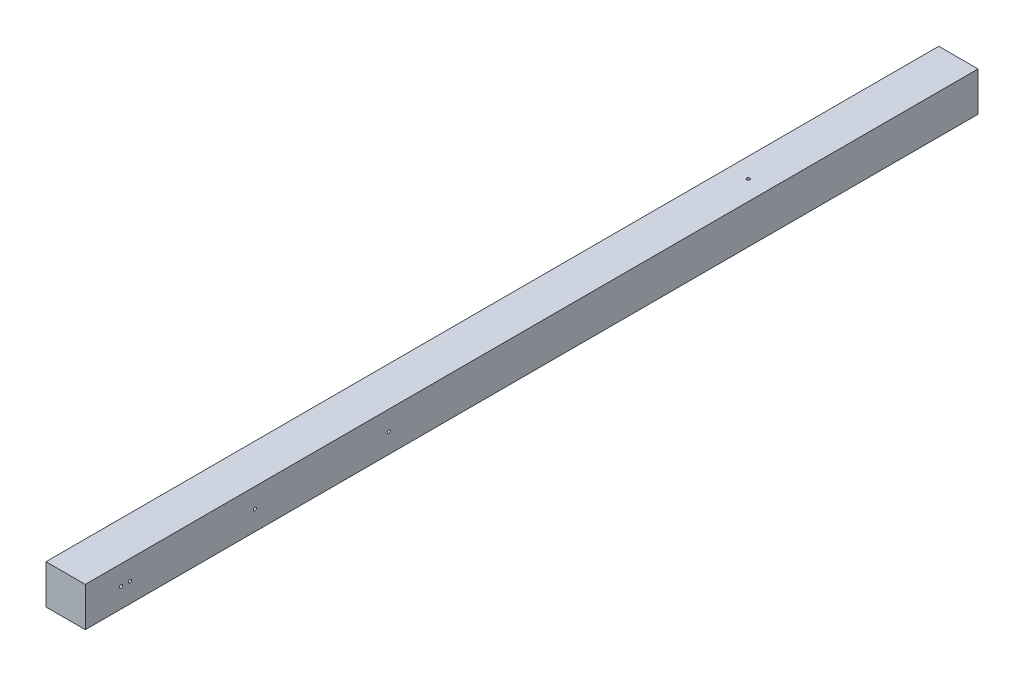
ISO-10303-21;
HEADER;
FILE_DESCRIPTION(('STEP AP214'),'2;1');
FILE_NAME('part.step','',(''),(''),'','','');
FILE_SCHEMA(('AUTOMOTIVE_DESIGN { 1 0 10303 214 1 1 1 1 }'));
ENDSEC;
DATA;
#1=APPLICATION_CONTEXT('core data for automotive mechanical design processes');
#2=APPLICATION_PROTOCOL_DEFINITION('international standard','automotive_design',2000,#1);
#3=PRODUCT_CONTEXT('',#1,'mechanical');
#4=PRODUCT('Part','Part','',(#3));
#5=PRODUCT_RELATED_PRODUCT_CATEGORY('part','',(#4));
#6=PRODUCT_DEFINITION_FORMATION('','',#4);
#7=PRODUCT_DEFINITION_CONTEXT('part definition',#1,'design');
#8=PRODUCT_DEFINITION('design','',#6,#7);
#9=PRODUCT_DEFINITION_SHAPE('','',#8);
#10=(LENGTH_UNIT() NAMED_UNIT(*) SI_UNIT(.MILLI.,.METRE.));
#11=(NAMED_UNIT(*) PLANE_ANGLE_UNIT() SI_UNIT($,.RADIAN.));
#12=(NAMED_UNIT(*) SI_UNIT($,.STERADIAN.) SOLID_ANGLE_UNIT());
#13=UNCERTAINTY_MEASURE_WITH_UNIT(LENGTH_MEASURE(1.E-05),#10,'distance_accuracy_value','');
#14=(GEOMETRIC_REPRESENTATION_CONTEXT(3) GLOBAL_UNCERTAINTY_ASSIGNED_CONTEXT((#13)) GLOBAL_UNIT_ASSIGNED_CONTEXT((#10,
#11,#12)) REPRESENTATION_CONTEXT('',''));
#15=CARTESIAN_POINT('',(0.,0.,0.));
#16=DIRECTION('',(0.,0.,1.));
#17=DIRECTION('',(1.,0.,0.));
#18=AXIS2_PLACEMENT_3D('',#15,#16,#17);
#19=CARTESIAN_POINT('',(-22.,22.,1000.));
#20=DIRECTION('',(1.,0.,0.));
#21=DIRECTION('',(0.,1.,0.));
#22=AXIS2_PLACEMENT_3D('',#19,#20,#21);
#23=PLANE('',#22);
#24=CARTESIAN_POINT('',(-22.,0.,660.));
#25=DIRECTION('',(-1.,0.,0.));
#26=DIRECTION('',(0.,-1.,0.));
#27=AXIS2_PLACEMENT_3D('',#24,#25,#26);
#28=CIRCLE('',#27,1.75000000000009);
#29=CARTESIAN_POINT('',(-22.,-1.75000000000009,660.));
#30=VERTEX_POINT('',#29);
#31=EDGE_CURVE('E128',#30,#30,#28,.T.);
#32=ORIENTED_EDGE('',*,*,#31,.F.);
#33=EDGE_LOOP('',(#32));
#34=FACE_BOUND('',#33,.T.);
#35=CARTESIAN_POINT('',(-22.,0.,810.));
#36=DIRECTION('',(-1.,0.,0.));
#37=DIRECTION('',(0.,-1.,0.));
#38=AXIS2_PLACEMENT_3D('',#35,#36,#37);
#39=CIRCLE('',#38,1.74999999999999);
#40=CARTESIAN_POINT('',(-22.,-1.74999999999999,810.));
#41=VERTEX_POINT('',#40);
#42=EDGE_CURVE('E136',#41,#41,#39,.T.);
#43=ORIENTED_EDGE('',*,*,#42,.F.);
#44=EDGE_LOOP('',(#43));
#45=FACE_BOUND('',#44,.T.);
#46=CARTESIAN_POINT('',(-22.,0.,960.));
#47=DIRECTION('',(-1.,0.,0.));
#48=DIRECTION('',(0.,-1.,0.));
#49=AXIS2_PLACEMENT_3D('',#46,#47,#48);
#50=CIRCLE('',#49,1.74999999999999);
#51=CARTESIAN_POINT('',(-22.,-1.74999999999999,960.));
#52=VERTEX_POINT('',#51);
#53=EDGE_CURVE('E127',#52,#52,#50,.T.);
#54=ORIENTED_EDGE('',*,*,#53,.F.);
#55=EDGE_LOOP('',(#54));
#56=FACE_BOUND('',#55,.T.);
#57=CARTESIAN_POINT('',(-22.,0.,950.));
#58=DIRECTION('',(-1.,0.,0.));
#59=DIRECTION('',(0.,-1.,0.));
#60=AXIS2_PLACEMENT_3D('',#57,#58,#59);
#61=CIRCLE('',#60,1.74999999999999);
#62=CARTESIAN_POINT('',(-22.,-1.74999999999999,950.));
#63=VERTEX_POINT('',#62);
#64=EDGE_CURVE('E124',#63,#63,#61,.T.);
#65=ORIENTED_EDGE('',*,*,#64,.F.);
#66=EDGE_LOOP('',(#65));
#67=FACE_BOUND('',#66,.T.);
#68=DIRECTION('',(0.,-1.,0.));
#69=VECTOR('',#68,1.);
#70=CARTESIAN_POINT('',(-22.,22.,0.));
#71=LINE('',#70,#69);
#72=CARTESIAN_POINT('',(-22.,22.,0.));
#73=VERTEX_POINT('',#72);
#74=CARTESIAN_POINT('',(-22.,-22.,0.));
#75=VERTEX_POINT('',#74);
#76=EDGE_CURVE('E108',#73,#75,#71,.T.);
#77=ORIENTED_EDGE('',*,*,#76,.T.);
#78=DIRECTION('',(0.,0.,-1.));
#79=VECTOR('',#78,1.);
#80=CARTESIAN_POINT('',(-22.,-22.,1000.));
#81=LINE('',#80,#79);
#82=CARTESIAN_POINT('',(-22.,-22.,1000.));
#83=VERTEX_POINT('',#82);
#84=EDGE_CURVE('E11',#83,#75,#81,.T.);
#85=ORIENTED_EDGE('',*,*,#84,.F.);
#86=DIRECTION('',(0.,-1.,0.));
#87=VECTOR('',#86,1.);
#88=CARTESIAN_POINT('',(-22.,22.,1000.));
#89=LINE('',#88,#87);
#90=CARTESIAN_POINT('',(-22.,22.,1000.));
#91=VERTEX_POINT('',#90);
#92=EDGE_CURVE('E96',#91,#83,#89,.T.);
#93=ORIENTED_EDGE('',*,*,#92,.F.);
#94=DIRECTION('',(0.,0.,-1.));
#95=VECTOR('',#94,1.);
#96=CARTESIAN_POINT('',(-22.,22.,1000.));
#97=LINE('',#96,#95);
#98=EDGE_CURVE('E104',#91,#73,#97,.T.);
#99=ORIENTED_EDGE('',*,*,#98,.T.);
#100=EDGE_LOOP('',(#77,#85,#93,#99));
#101=FACE_BOUND('',#100,.T.);
#102=ADVANCED_FACE('F45',(#34,#45,#56,#67,#101),#23,.F.);
#103=CARTESIAN_POINT('',(22.,-22.,1000.));
#104=DIRECTION('',(0.,1.,0.));
#105=DIRECTION('',(-1.,0.,0.));
#106=AXIS2_PLACEMENT_3D('',#103,#104,#105);
#107=PLANE('',#106);
#108=CARTESIAN_POINT('',(0.,-22.,235.31));
#109=DIRECTION('',(0.,1.,0.));
#110=DIRECTION('',(-1.,0.,0.));
#111=AXIS2_PLACEMENT_3D('',#108,#109,#110);
#112=CIRCLE('',#111,1.75);
#113=CARTESIAN_POINT('',(-1.75,-22.,235.31));
#114=VERTEX_POINT('',#113);
#115=EDGE_CURVE('E135',#114,#114,#112,.F.);
#116=ORIENTED_EDGE('',*,*,#115,.F.);
#117=EDGE_LOOP('',(#116));
#118=FACE_BOUND('',#117,.T.);
#119=DIRECTION('',(1.,0.,0.));
#120=VECTOR('',#119,1.);
#121=CARTESIAN_POINT('',(22.,-22.,0.));
#122=LINE('',#121,#120);
#123=CARTESIAN_POINT('',(22.,-22.,0.));
#124=VERTEX_POINT('',#123);
#125=EDGE_CURVE('E100',#75,#124,#122,.T.);
#126=ORIENTED_EDGE('',*,*,#125,.T.);
#127=DIRECTION('',(0.,0.,-1.));
#128=VECTOR('',#127,1.);
#129=CARTESIAN_POINT('',(22.,-22.,1000.));
#130=LINE('',#129,#128);
#131=CARTESIAN_POINT('',(22.,-22.,1000.));
#132=VERTEX_POINT('',#131);
#133=EDGE_CURVE('E53',#132,#124,#130,.T.);
#134=ORIENTED_EDGE('',*,*,#133,.F.);
#135=DIRECTION('',(1.,0.,0.));
#136=VECTOR('',#135,1.);
#137=CARTESIAN_POINT('',(22.,-22.,1000.));
#138=LINE('',#137,#136);
#139=EDGE_CURVE('E91',#83,#132,#138,.T.);
#140=ORIENTED_EDGE('',*,*,#139,.F.);
#141=ORIENTED_EDGE('',*,*,#84,.T.);
#142=EDGE_LOOP('',(#126,#134,#140,#141));
#143=FACE_BOUND('',#142,.T.);
#144=ADVANCED_FACE('F99',(#118,#143),#107,.F.);
#145=CARTESIAN_POINT('',(22.,22.,1000.));
#146=DIRECTION('',(-1.,0.,0.));
#147=DIRECTION('',(0.,-1.,0.));
#148=AXIS2_PLACEMENT_3D('',#145,#146,#147);
#149=PLANE('',#148);
#150=CARTESIAN_POINT('',(22.,0.,660.));
#151=DIRECTION('',(-1.,0.,0.));
#152=DIRECTION('',(0.,-1.,0.));
#153=AXIS2_PLACEMENT_3D('',#150,#151,#152);
#154=CIRCLE('',#153,1.75000000000009);
#155=CARTESIAN_POINT('',(22.,-1.75000000000009,660.));
#156=VERTEX_POINT('',#155);
#157=EDGE_CURVE('E132',#156,#156,#154,.F.);
#158=ORIENTED_EDGE('',*,*,#157,.F.);
#159=EDGE_LOOP('',(#158));
#160=FACE_BOUND('',#159,.T.);
#161=CARTESIAN_POINT('',(22.,0.,810.));
#162=DIRECTION('',(-1.,0.,0.));
#163=DIRECTION('',(0.,-1.,0.));
#164=AXIS2_PLACEMENT_3D('',#161,#162,#163);
#165=CIRCLE('',#164,1.74999999999999);
#166=CARTESIAN_POINT('',(22.,-1.74999999999998,810.));
#167=VERTEX_POINT('',#166);
#168=EDGE_CURVE('E131',#167,#167,#165,.F.);
#169=ORIENTED_EDGE('',*,*,#168,.F.);
#170=EDGE_LOOP('',(#169));
#171=FACE_BOUND('',#170,.T.);
#172=CARTESIAN_POINT('',(22.,0.,960.));
#173=DIRECTION('',(-1.,0.,0.));
#174=DIRECTION('',(0.,-1.,0.));
#175=AXIS2_PLACEMENT_3D('',#172,#173,#174);
#176=CIRCLE('',#175,1.74999999999999);
#177=CARTESIAN_POINT('',(22.,-1.74999999999998,960.));
#178=VERTEX_POINT('',#177);
#179=EDGE_CURVE('E139',#178,#178,#176,.F.);
#180=ORIENTED_EDGE('',*,*,#179,.F.);
#181=EDGE_LOOP('',(#180));
#182=FACE_BOUND('',#181,.T.);
#183=CARTESIAN_POINT('',(22.,0.,950.));
#184=DIRECTION('',(-1.,0.,0.));
#185=DIRECTION('',(0.,-1.,0.));
#186=AXIS2_PLACEMENT_3D('',#183,#184,#185);
#187=CIRCLE('',#186,1.74999999999999);
#188=CARTESIAN_POINT('',(22.,-1.74999999999998,950.));
#189=VERTEX_POINT('',#188);
#190=EDGE_CURVE('E111',#189,#189,#187,.F.);
#191=ORIENTED_EDGE('',*,*,#190,.F.);
#192=EDGE_LOOP('',(#191));
#193=FACE_BOUND('',#192,.T.);
#194=DIRECTION('',(0.,1.,0.));
#195=VECTOR('',#194,1.);
#196=CARTESIAN_POINT('',(22.,22.,0.));
#197=LINE('',#196,#195);
#198=CARTESIAN_POINT('',(22.,22.,0.));
#199=VERTEX_POINT('',#198);
#200=EDGE_CURVE('E78',#124,#199,#197,.T.);
#201=ORIENTED_EDGE('',*,*,#200,.T.);
#202=DIRECTION('',(0.,0.,-1.));
#203=VECTOR('',#202,1.);
#204=CARTESIAN_POINT('',(22.,22.,1000.));
#205=LINE('',#204,#203);
#206=CARTESIAN_POINT('',(22.,22.,1000.));
#207=VERTEX_POINT('',#206);
#208=EDGE_CURVE('E101',#207,#199,#205,.T.);
#209=ORIENTED_EDGE('',*,*,#208,.F.);
#210=DIRECTION('',(0.,1.,0.));
#211=VECTOR('',#210,1.);
#212=CARTESIAN_POINT('',(22.,22.,1000.));
#213=LINE('',#212,#211);
#214=EDGE_CURVE('E94',#132,#207,#213,.T.);
#215=ORIENTED_EDGE('',*,*,#214,.F.);
#216=ORIENTED_EDGE('',*,*,#133,.T.);
#217=EDGE_LOOP('',(#201,#209,#215,#216));
#218=FACE_BOUND('',#217,.T.);
#219=ADVANCED_FACE('F102',(#160,#171,#182,#193,#218),#149,.F.);
#220=CARTESIAN_POINT('',(22.,22.,1000.));
#221=DIRECTION('',(0.,-1.,0.));
#222=DIRECTION('',(1.,0.,0.));
#223=AXIS2_PLACEMENT_3D('',#220,#221,#222);
#224=PLANE('',#223);
#225=CARTESIAN_POINT('',(0.,22.,235.31));
#226=DIRECTION('',(0.,1.,0.));
#227=DIRECTION('',(-1.,0.,0.));
#228=AXIS2_PLACEMENT_3D('',#225,#226,#227);
#229=CIRCLE('',#228,1.75);
#230=CARTESIAN_POINT('',(-1.75,22.,235.31));
#231=VERTEX_POINT('',#230);
#232=EDGE_CURVE('E148',#231,#231,#229,.T.);
#233=ORIENTED_EDGE('',*,*,#232,.F.);
#234=EDGE_LOOP('',(#233));
#235=FACE_BOUND('',#234,.T.);
#236=DIRECTION('',(-1.,0.,0.));
#237=VECTOR('',#236,1.);
#238=CARTESIAN_POINT('',(22.,22.,0.));
#239=LINE('',#238,#237);
#240=EDGE_CURVE('E84',#199,#73,#239,.T.);
#241=ORIENTED_EDGE('',*,*,#240,.T.);
#242=ORIENTED_EDGE('',*,*,#98,.F.);
#243=DIRECTION('',(-1.,0.,0.));
#244=VECTOR('',#243,1.);
#245=CARTESIAN_POINT('',(22.,22.,1000.));
#246=LINE('',#245,#244);
#247=EDGE_CURVE('E61',#207,#91,#246,.T.);
#248=ORIENTED_EDGE('',*,*,#247,.F.);
#249=ORIENTED_EDGE('',*,*,#208,.T.);
#250=EDGE_LOOP('',(#241,#242,#248,#249));
#251=FACE_BOUND('',#250,.T.);
#252=ADVANCED_FACE('F116',(#235,#251),#224,.F.);
#253=CARTESIAN_POINT('',(0.,0.,1000.));
#254=DIRECTION('',(0.,0.,-1.));
#255=DIRECTION('',(-1.,0.,0.));
#256=AXIS2_PLACEMENT_3D('',#253,#254,#255);
#257=PLANE('',#256);
#258=ORIENTED_EDGE('',*,*,#92,.T.);
#259=ORIENTED_EDGE('',*,*,#139,.T.);
#260=ORIENTED_EDGE('',*,*,#214,.T.);
#261=ORIENTED_EDGE('',*,*,#247,.T.);
#262=EDGE_LOOP('',(#258,#259,#260,#261));
#263=FACE_BOUND('',#262,.T.);
#264=ADVANCED_FACE('F92',(#263),#257,.F.);
#265=CARTESIAN_POINT('',(0.,0.,0.));
#266=DIRECTION('',(0.,0.,-1.));
#267=DIRECTION('',(-1.,0.,0.));
#268=AXIS2_PLACEMENT_3D('',#265,#266,#267);
#269=PLANE('',#268);
#270=ORIENTED_EDGE('',*,*,#76,.F.);
#271=ORIENTED_EDGE('',*,*,#240,.F.);
#272=ORIENTED_EDGE('',*,*,#200,.F.);
#273=ORIENTED_EDGE('',*,*,#125,.F.);
#274=EDGE_LOOP('',(#270,#271,#272,#273));
#275=FACE_BOUND('',#274,.T.);
#276=ADVANCED_FACE('F119',(#275),#269,.T.);
#277=CARTESIAN_POINT('',(26.9497474683062,0.,950.));
#278=DIRECTION('',(-1.,0.,0.));
#279=DIRECTION('',(0.,-1.,0.));
#280=AXIS2_PLACEMENT_3D('',#277,#278,#279);
#281=CYLINDRICAL_SURFACE('',#280,1.74999999999999);
#282=ORIENTED_EDGE('',*,*,#190,.T.);
#283=EDGE_LOOP('',(#282));
#284=FACE_BOUND('',#283,.T.);
#285=ORIENTED_EDGE('',*,*,#64,.T.);
#286=EDGE_LOOP('',(#285));
#287=FACE_BOUND('',#286,.T.);
#288=ADVANCED_FACE('F180',(#284,#287),#281,.F.);
#289=CARTESIAN_POINT('',(26.9497474683062,0.,960.));
#290=DIRECTION('',(-1.,0.,0.));
#291=DIRECTION('',(0.,-1.,0.));
#292=AXIS2_PLACEMENT_3D('',#289,#290,#291);
#293=CYLINDRICAL_SURFACE('',#292,1.74999999999999);
#294=ORIENTED_EDGE('',*,*,#179,.T.);
#295=EDGE_LOOP('',(#294));
#296=FACE_BOUND('',#295,.T.);
#297=ORIENTED_EDGE('',*,*,#53,.T.);
#298=EDGE_LOOP('',(#297));
#299=FACE_BOUND('',#298,.T.);
#300=ADVANCED_FACE('F182',(#296,#299),#293,.F.);
#301=CARTESIAN_POINT('',(26.9497474683062,0.,810.));
#302=DIRECTION('',(-1.,0.,0.));
#303=DIRECTION('',(0.,-1.,0.));
#304=AXIS2_PLACEMENT_3D('',#301,#302,#303);
#305=CYLINDRICAL_SURFACE('',#304,1.74999999999999);
#306=ORIENTED_EDGE('',*,*,#168,.T.);
#307=EDGE_LOOP('',(#306));
#308=FACE_BOUND('',#307,.T.);
#309=ORIENTED_EDGE('',*,*,#42,.T.);
#310=EDGE_LOOP('',(#309));
#311=FACE_BOUND('',#310,.T.);
#312=ADVANCED_FACE('F188',(#308,#311),#305,.F.);
#313=CARTESIAN_POINT('',(26.9497474683062,0.,660.));
#314=DIRECTION('',(-1.,0.,0.));
#315=DIRECTION('',(0.,-1.,0.));
#316=AXIS2_PLACEMENT_3D('',#313,#314,#315);
#317=CYLINDRICAL_SURFACE('',#316,1.75000000000009);
#318=ORIENTED_EDGE('',*,*,#157,.T.);
#319=EDGE_LOOP('',(#318));
#320=FACE_BOUND('',#319,.T.);
#321=ORIENTED_EDGE('',*,*,#31,.T.);
#322=EDGE_LOOP('',(#321));
#323=FACE_BOUND('',#322,.T.);
#324=ADVANCED_FACE('F192',(#320,#323),#317,.F.);
#325=CARTESIAN_POINT('',(0.,-26.9497474683058,235.31));
#326=DIRECTION('',(0.,1.,0.));
#327=DIRECTION('',(-1.,0.,0.));
#328=AXIS2_PLACEMENT_3D('',#325,#326,#327);
#329=CYLINDRICAL_SURFACE('',#328,1.75);
#330=ORIENTED_EDGE('',*,*,#115,.T.);
#331=EDGE_LOOP('',(#330));
#332=FACE_BOUND('',#331,.T.);
#333=ORIENTED_EDGE('',*,*,#232,.T.);
#334=EDGE_LOOP('',(#333));
#335=FACE_BOUND('',#334,.T.);
#336=ADVANCED_FACE('F152',(#332,#335),#329,.F.);
#337=CLOSED_SHELL('',(#102,#144,#219,#252,#264,#276,#288,#300,#312,#324,#336));
#338=MANIFOLD_SOLID_BREP('B2',#337);
#339=ADVANCED_BREP_SHAPE_REPRESENTATION('',(#18,#338),#14);
#340=SHAPE_DEFINITION_REPRESENTATION(#9,#339);
ENDSEC;
END-ISO-10303-21;
